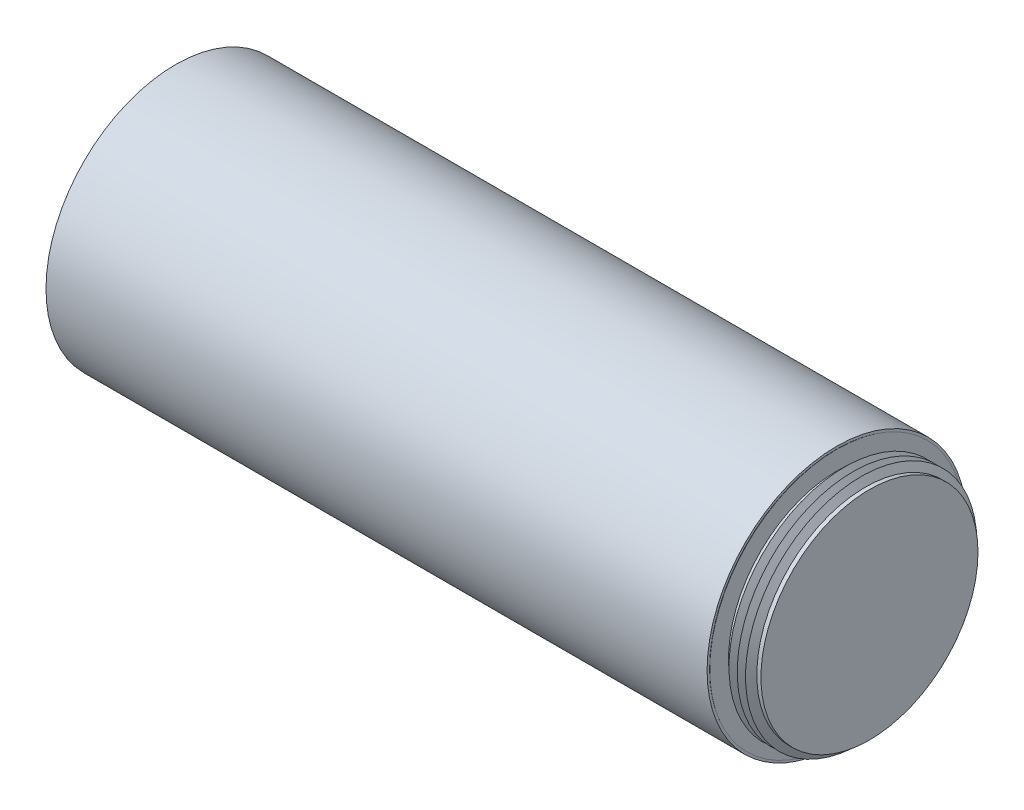
ISO-10303-21;
HEADER;
FILE_DESCRIPTION(('STEP AP214'),'2;1');
FILE_NAME('part.step','',(''),(''),'','','');
FILE_SCHEMA(('AUTOMOTIVE_DESIGN { 1 0 10303 214 1 1 1 1 }'));
ENDSEC;
DATA;
#1=APPLICATION_CONTEXT('core data for automotive mechanical design processes');
#2=APPLICATION_PROTOCOL_DEFINITION('international standard','automotive_design',2000,#1);
#3=PRODUCT_CONTEXT('',#1,'mechanical');
#4=PRODUCT('Part','Part','',(#3));
#5=PRODUCT_RELATED_PRODUCT_CATEGORY('part','',(#4));
#6=PRODUCT_DEFINITION_FORMATION('','',#4);
#7=PRODUCT_DEFINITION_CONTEXT('part definition',#1,'design');
#8=PRODUCT_DEFINITION('design','',#6,#7);
#9=PRODUCT_DEFINITION_SHAPE('','',#8);
#10=(LENGTH_UNIT() NAMED_UNIT(*) SI_UNIT(.MILLI.,.METRE.));
#11=(NAMED_UNIT(*) PLANE_ANGLE_UNIT() SI_UNIT($,.RADIAN.));
#12=(NAMED_UNIT(*) SI_UNIT($,.STERADIAN.) SOLID_ANGLE_UNIT());
#13=UNCERTAINTY_MEASURE_WITH_UNIT(LENGTH_MEASURE(1.E-05),#10,'distance_accuracy_value','');
#14=(GEOMETRIC_REPRESENTATION_CONTEXT(3) GLOBAL_UNCERTAINTY_ASSIGNED_CONTEXT((#13)) GLOBAL_UNIT_ASSIGNED_CONTEXT((#10,
#11,#12)) REPRESENTATION_CONTEXT('',''));
#15=CARTESIAN_POINT('',(0.,0.,0.));
#16=DIRECTION('',(0.,0.,1.));
#17=DIRECTION('',(1.,0.,0.));
#18=AXIS2_PLACEMENT_3D('',#15,#16,#17);
#19=CARTESIAN_POINT('',(-101.282037882412,-112.40761589404,6.95959679333066E-13));
#20=DIRECTION('',(1.,0.,0.));
#21=DIRECTION('',(0.,0.203317589338989,0.979112842253324));
#22=AXIS2_PLACEMENT_3D('',#19,#20,#21);
#23=PLANE('',#22);
#24=CARTESIAN_POINT('',(-101.282037882412,-112.40761589404,6.95959679333066E-13));
#25=DIRECTION('',(1.,0.,0.));
#26=DIRECTION('',(0.,0.203317589338989,0.979112842253324));
#27=AXIS2_PLACEMENT_3D('',#24,#25,#26);
#28=CIRCLE('',#27,49.784);
#29=CARTESIAN_POINT('',(-101.282037882411,-102.285653026388,48.7441537387402));
#30=VERTEX_POINT('',#29);
#31=EDGE_CURVE('E67',#30,#30,#28,.T.);
#32=ORIENTED_EDGE('',*,*,#31,.T.);
#33=EDGE_LOOP('',(#32));
#34=FACE_BOUND('',#33,.T.);
#35=CARTESIAN_POINT('',(-101.282037882412,-112.40761589404,8.14057642514373E-13));
#36=DIRECTION('',(1.,0.,0.));
#37=DIRECTION('',(0.,0.,-1.));
#38=AXIS2_PLACEMENT_3D('',#35,#36,#37);
#39=CIRCLE('',#38,48.8237923991093);
#40=CARTESIAN_POINT('',(-101.282037882412,-112.40761589404,-48.8237923991085));
#41=VERTEX_POINT('',#40);
#42=EDGE_CURVE('E18',#41,#41,#39,.T.);
#43=ORIENTED_EDGE('',*,*,#42,.F.);
#44=EDGE_LOOP('',(#43));
#45=FACE_BOUND('',#44,.T.);
#46=ADVANCED_FACE('F14',(#34,#45),#23,.T.);
#47=CARTESIAN_POINT('',(-355.282037882411,-112.40761589404,9.63216570958789E-13));
#48=DIRECTION('',(1.,0.,0.));
#49=DIRECTION('',(0.,0.203317589338989,0.979112842253324));
#50=AXIS2_PLACEMENT_3D('',#47,#48,#49);
#51=PLANE('',#50);
#52=CARTESIAN_POINT('',(-355.282037882411,-112.40761589404,9.63216570958789E-13));
#53=DIRECTION('',(1.,0.,0.));
#54=DIRECTION('',(0.,0.203317589338989,0.979112842253324));
#55=AXIS2_PLACEMENT_3D('',#52,#53,#54);
#56=CIRCLE('',#55,49.784);
#57=CARTESIAN_POINT('',(-355.282037882411,-102.285653026388,48.7441537387404));
#58=VERTEX_POINT('',#57);
#59=EDGE_CURVE('E68',#58,#58,#56,.T.);
#60=ORIENTED_EDGE('',*,*,#59,.F.);
#61=EDGE_LOOP('',(#60));
#62=FACE_BOUND('',#61,.T.);
#63=CARTESIAN_POINT('',(-355.282037882411,-112.40761589404,9.52272127238655E-13));
#64=DIRECTION('',(1.,0.,0.));
#65=DIRECTION('',(0.,0.,-1.));
#66=AXIS2_PLACEMENT_3D('',#63,#64,#65);
#67=CIRCLE('',#66,48.9203999999995);
#68=CARTESIAN_POINT('',(-355.282037882412,-112.40761589404,-48.9203999999986));
#69=VERTEX_POINT('',#68);
#70=EDGE_CURVE('E64',#69,#69,#67,.F.);
#71=ORIENTED_EDGE('',*,*,#70,.F.);
#72=EDGE_LOOP('',(#71));
#73=FACE_BOUND('',#72,.T.);
#74=ADVANCED_FACE('F276',(#62,#73),#51,.F.);
#75=CARTESIAN_POINT('',(-101.282037882412,-112.40761589404,6.95959679333066E-13));
#76=DIRECTION('',(-1.,0.,0.));
#77=DIRECTION('',(0.,-0.203317589338989,-0.979112842253324));
#78=AXIS2_PLACEMENT_3D('',#75,#76,#77);
#79=CYLINDRICAL_SURFACE('',#78,49.784);
#80=ORIENTED_EDGE('',*,*,#31,.F.);
#81=EDGE_LOOP('',(#80));
#82=FACE_BOUND('',#81,.T.);
#83=ORIENTED_EDGE('',*,*,#59,.T.);
#84=EDGE_LOOP('',(#83));
#85=FACE_BOUND('',#84,.T.);
#86=ADVANCED_FACE('F283',(#82,#85),#79,.T.);
#87=CARTESIAN_POINT('',(-355.282037882412,-112.40761589404,9.45369184288484E-13));
#88=DIRECTION('',(1.,0.,0.));
#89=DIRECTION('',(0.,0.999990910254518,-0.00426373173999859));
#90=AXIS2_PLACEMENT_3D('',#87,#88,#89);
#91=CIRCLE('',#90,44.45);
#92=CARTESIAN_POINT('',(-355.282037882412,-67.9580199332265,-0.189522875841992));
#93=VERTEX_POINT('',#92);
#94=EDGE_CURVE('E155',#93,#93,#91,.T.);
#95=ORIENTED_EDGE('',*,*,#94,.T.);
#96=EDGE_LOOP('',(#95));
#97=FACE_BOUND('',#96,.T.);
#98=ORIENTED_EDGE('',*,*,#70,.T.);
#99=EDGE_LOOP('',(#98));
#100=FACE_BOUND('',#99,.T.);
#101=ADVANCED_FACE('F163',(#97,#100),#51,.F.);
#102=CARTESIAN_POINT('',(-101.114708609272,-112.40761589404,7.84938641112028E-13));
#103=DIRECTION('',(1.,0.,0.));
#104=DIRECTION('',(0.,0.,-1.));
#105=AXIS2_PLACEMENT_3D('',#102,#103,#104);
#106=CONICAL_SURFACE('',#105,48.9204,0.523598775598301);
#107=ORIENTED_EDGE('',*,*,#42,.T.);
#108=EDGE_LOOP('',(#107));
#109=FACE_BOUND('',#108,.T.);
#110=CARTESIAN_POINT('',(-101.114708609272,-112.40761589404,7.84938641112028E-13));
#111=DIRECTION('',(-1.,0.,0.));
#112=DIRECTION('',(0.,0.,1.));
#113=AXIS2_PLACEMENT_3D('',#110,#111,#112);
#114=CIRCLE('',#113,48.9204);
#115=CARTESIAN_POINT('',(-101.114708609272,-112.40761589404,48.9204000000008));
#116=VERTEX_POINT('',#115);
#117=EDGE_CURVE('E9',#116,#116,#114,.T.);
#118=ORIENTED_EDGE('',*,*,#117,.T.);
#119=EDGE_LOOP('',(#118));
#120=FACE_BOUND('',#119,.T.);
#121=ADVANCED_FACE('F16',(#109,#120),#106,.T.);
#122=CARTESIAN_POINT('',(-101.114708609272,-63.4872158940397,7.84938641112028E-13));
#123=DIRECTION('',(-1.,0.,0.));
#124=DIRECTION('',(0.,0.,1.));
#125=AXIS2_PLACEMENT_3D('',#122,#123,#124);
#126=PLANE('',#125);
#127=ORIENTED_EDGE('',*,*,#117,.F.);
#128=EDGE_LOOP('',(#127));
#129=FACE_BOUND('',#128,.T.);
#130=CARTESIAN_POINT('',(-101.114708609271,-112.40761589404,7.84938641112028E-13));
#131=DIRECTION('',(1.,0.,0.));
#132=DIRECTION('',(0.,0.,-1.));
#133=AXIS2_PLACEMENT_3D('',#130,#131,#132);
#134=CIRCLE('',#133,41.70035475);
#135=CARTESIAN_POINT('',(-101.114708609271,-112.40761589404,-41.7003547499992));
#136=VERTEX_POINT('',#135);
#137=EDGE_CURVE('E23',#136,#136,#134,.T.);
#138=ORIENTED_EDGE('',*,*,#137,.F.);
#139=EDGE_LOOP('',(#138));
#140=FACE_BOUND('',#139,.T.);
#141=ADVANCED_FACE('F329',(#129,#140),#126,.F.);
#142=CARTESIAN_POINT('',(-88.6687086092715,-67.9576158940398,7.84938641112028E-13));
#143=DIRECTION('',(-1.,0.,0.));
#144=DIRECTION('',(0.,0.,1.));
#145=AXIS2_PLACEMENT_3D('',#142,#143,#144);
#146=PLANE('',#145);
#147=CARTESIAN_POINT('',(-88.6687086092715,-112.40761589404,7.84938641112028E-13));
#148=DIRECTION('',(1.,0.,0.));
#149=DIRECTION('',(0.,0.,-1.));
#150=AXIS2_PLACEMENT_3D('',#147,#148,#149);
#151=CIRCLE('',#150,41.70035475);
#152=CARTESIAN_POINT('',(-88.6687086092715,-112.40761589404,-41.7003547499992));
#153=VERTEX_POINT('',#152);
#154=EDGE_CURVE('E60',#153,#153,#151,.T.);
#155=ORIENTED_EDGE('',*,*,#154,.T.);
#156=EDGE_LOOP('',(#155));
#157=FACE_BOUND('',#156,.T.);
#158=ADVANCED_FACE('F326',(#157),#146,.F.);
#159=CARTESIAN_POINT('',(-88.6687086092715,-112.40761589404,7.84938641112028E-13));
#160=DIRECTION('',(1.,0.,0.));
#161=DIRECTION('',(0.,0.,-1.));
#162=AXIS2_PLACEMENT_3D('',#159,#160,#161);
#163=CYLINDRICAL_SURFACE('',#162,41.70035475);
#164=CARTESIAN_POINT('',(-99.7812591608523,-112.40761589404,7.84938641112028E-13));
#165=DIRECTION('',(1.,0.,0.));
#166=DIRECTION('',(0.,0.,-1.));
#167=AXIS2_PLACEMENT_3D('',#164,#165,#166);
#168=CIRCLE('',#167,41.70035475);
#169=CARTESIAN_POINT('',(-99.7812591608523,-112.40761589404,-41.7003547499992));
#170=VERTEX_POINT('',#169);
#171=EDGE_CURVE('E30',#170,#170,#168,.T.);
#172=ORIENTED_EDGE('',*,*,#171,.F.);
#173=EDGE_LOOP('',(#172));
#174=FACE_BOUND('',#173,.T.);
#175=ORIENTED_EDGE('',*,*,#137,.T.);
#176=EDGE_LOOP('',(#175));
#177=FACE_BOUND('',#176,.T.);
#178=ADVANCED_FACE('F322',(#174,#177),#163,.T.);
#179=CARTESIAN_POINT('',(-99.7812591608523,-112.40761589404,7.84938641112028E-13));
#180=DIRECTION('',(1.,0.,0.));
#181=DIRECTION('',(0.,0.,-1.));
#182=AXIS2_PLACEMENT_3D('',#179,#180,#181);
#183=CONICAL_SURFACE('',#182,41.70035475,1.0471975511966);
#184=CARTESIAN_POINT('',(-98.1937507355888,-112.40761589404,7.84938641112028E-13));
#185=DIRECTION('',(1.,0.,0.));
#186=DIRECTION('',(0.,0.,-1.));
#187=AXIS2_PLACEMENT_3D('',#184,#185,#186);
#188=CIRCLE('',#187,44.45);
#189=CARTESIAN_POINT('',(-98.1937507355888,-112.40761589404,-44.4499999999992));
#190=VERTEX_POINT('',#189);
#191=EDGE_CURVE('E36',#190,#190,#188,.T.);
#192=ORIENTED_EDGE('',*,*,#191,.F.);
#193=EDGE_LOOP('',(#192));
#194=FACE_BOUND('',#193,.T.);
#195=ORIENTED_EDGE('',*,*,#171,.T.);
#196=EDGE_LOOP('',(#195));
#197=FACE_BOUND('',#196,.T.);
#198=ADVANCED_FACE('F318',(#194,#197),#183,.T.);
#199=CARTESIAN_POINT('',(-98.1937507355888,-112.40761589404,7.84938641112028E-13));
#200=DIRECTION('',(-1.,0.,0.));
#201=DIRECTION('',(0.,0.,1.));
#202=AXIS2_PLACEMENT_3D('',#199,#200,#201);
#203=CONICAL_SURFACE('',#202,44.45,1.0471975511966);
#204=CARTESIAN_POINT('',(-96.6062423103254,-112.40761589404,7.84938641112028E-13));
#205=DIRECTION('',(1.,0.,0.));
#206=DIRECTION('',(0.,0.,-1.));
#207=AXIS2_PLACEMENT_3D('',#204,#205,#206);
#208=CIRCLE('',#207,41.70035475);
#209=CARTESIAN_POINT('',(-96.6062423103254,-112.40761589404,-41.7003547499992));
#210=VERTEX_POINT('',#209);
#211=EDGE_CURVE('E40',#210,#210,#208,.T.);
#212=ORIENTED_EDGE('',*,*,#211,.F.);
#213=EDGE_LOOP('',(#212));
#214=FACE_BOUND('',#213,.T.);
#215=ORIENTED_EDGE('',*,*,#191,.T.);
#216=EDGE_LOOP('',(#215));
#217=FACE_BOUND('',#216,.T.);
#218=ADVANCED_FACE('F314',(#214,#217),#203,.T.);
#219=CARTESIAN_POINT('',(-96.6062423103254,-112.40761589404,7.84938641112028E-13));
#220=DIRECTION('',(1.,0.,0.));
#221=DIRECTION('',(0.,0.,-1.));
#222=AXIS2_PLACEMENT_3D('',#219,#220,#221);
#223=CONICAL_SURFACE('',#222,41.70035475,1.0471975511966);
#224=CARTESIAN_POINT('',(-95.0187338850619,-112.40761589404,7.84938641112028E-13));
#225=DIRECTION('',(1.,0.,0.));
#226=DIRECTION('',(0.,0.,-1.));
#227=AXIS2_PLACEMENT_3D('',#224,#225,#226);
#228=CIRCLE('',#227,44.45);
#229=CARTESIAN_POINT('',(-95.0187338850619,-112.40761589404,-44.4499999999992));
#230=VERTEX_POINT('',#229);
#231=EDGE_CURVE('E44',#230,#230,#228,.T.);
#232=ORIENTED_EDGE('',*,*,#231,.F.);
#233=EDGE_LOOP('',(#232));
#234=FACE_BOUND('',#233,.T.);
#235=ORIENTED_EDGE('',*,*,#211,.T.);
#236=EDGE_LOOP('',(#235));
#237=FACE_BOUND('',#236,.T.);
#238=ADVANCED_FACE('F310',(#234,#237),#223,.T.);
#239=CARTESIAN_POINT('',(-95.0187338850619,-112.40761589404,7.84938641112028E-13));
#240=DIRECTION('',(-1.,0.,0.));
#241=DIRECTION('',(0.,0.,1.));
#242=AXIS2_PLACEMENT_3D('',#239,#240,#241);
#243=CONICAL_SURFACE('',#242,44.45,1.0471975511966);
#244=CARTESIAN_POINT('',(-93.4312254597984,-112.40761589404,7.84938641112028E-13));
#245=DIRECTION('',(1.,0.,0.));
#246=DIRECTION('',(0.,0.,-1.));
#247=AXIS2_PLACEMENT_3D('',#244,#245,#246);
#248=CIRCLE('',#247,41.70035475);
#249=CARTESIAN_POINT('',(-93.4312254597984,-112.40761589404,-41.7003547499992));
#250=VERTEX_POINT('',#249);
#251=EDGE_CURVE('E48',#250,#250,#248,.T.);
#252=ORIENTED_EDGE('',*,*,#251,.F.);
#253=EDGE_LOOP('',(#252));
#254=FACE_BOUND('',#253,.T.);
#255=ORIENTED_EDGE('',*,*,#231,.T.);
#256=EDGE_LOOP('',(#255));
#257=FACE_BOUND('',#256,.T.);
#258=ADVANCED_FACE('F306',(#254,#257),#243,.T.);
#259=CARTESIAN_POINT('',(-93.4312254597984,-112.40761589404,7.84938641112028E-13));
#260=DIRECTION('',(1.,0.,0.));
#261=DIRECTION('',(0.,0.,-1.));
#262=AXIS2_PLACEMENT_3D('',#259,#260,#261);
#263=CONICAL_SURFACE('',#262,41.70035475,1.0471975511966);
#264=CARTESIAN_POINT('',(-91.843717034535,-112.40761589404,7.84938641112028E-13));
#265=DIRECTION('',(1.,0.,0.));
#266=DIRECTION('',(0.,0.,-1.));
#267=AXIS2_PLACEMENT_3D('',#264,#265,#266);
#268=CIRCLE('',#267,44.45);
#269=CARTESIAN_POINT('',(-91.843717034535,-112.40761589404,-44.4499999999992));
#270=VERTEX_POINT('',#269);
#271=EDGE_CURVE('E52',#270,#270,#268,.T.);
#272=ORIENTED_EDGE('',*,*,#271,.F.);
#273=EDGE_LOOP('',(#272));
#274=FACE_BOUND('',#273,.T.);
#275=ORIENTED_EDGE('',*,*,#251,.T.);
#276=EDGE_LOOP('',(#275));
#277=FACE_BOUND('',#276,.T.);
#278=ADVANCED_FACE('F302',(#274,#277),#263,.T.);
#279=CARTESIAN_POINT('',(-91.843717034535,-112.40761589404,7.84938641112028E-13));
#280=DIRECTION('',(-1.,0.,0.));
#281=DIRECTION('',(0.,0.,1.));
#282=AXIS2_PLACEMENT_3D('',#279,#280,#281);
#283=CONICAL_SURFACE('',#282,44.45,1.04719755119659);
#284=CARTESIAN_POINT('',(-90.2562086092715,-112.40761589404,7.84938641112028E-13));
#285=DIRECTION('',(1.,0.,0.));
#286=DIRECTION('',(0.,0.,-1.));
#287=AXIS2_PLACEMENT_3D('',#284,#285,#286);
#288=CIRCLE('',#287,41.70035475);
#289=CARTESIAN_POINT('',(-90.2562086092715,-112.40761589404,-41.7003547499992));
#290=VERTEX_POINT('',#289);
#291=EDGE_CURVE('E56',#290,#290,#288,.T.);
#292=ORIENTED_EDGE('',*,*,#291,.F.);
#293=EDGE_LOOP('',(#292));
#294=FACE_BOUND('',#293,.T.);
#295=ORIENTED_EDGE('',*,*,#271,.T.);
#296=EDGE_LOOP('',(#295));
#297=FACE_BOUND('',#296,.T.);
#298=ADVANCED_FACE('F298',(#294,#297),#283,.T.);
#299=CARTESIAN_POINT('',(-88.6687086092715,-112.40761589404,7.84938641112028E-13));
#300=DIRECTION('',(1.,0.,0.));
#301=DIRECTION('',(0.,0.,-1.));
#302=AXIS2_PLACEMENT_3D('',#299,#300,#301);
#303=CYLINDRICAL_SURFACE('',#302,41.70035475);
#304=ORIENTED_EDGE('',*,*,#154,.F.);
#305=EDGE_LOOP('',(#304));
#306=FACE_BOUND('',#305,.T.);
#307=ORIENTED_EDGE('',*,*,#291,.T.);
#308=EDGE_LOOP('',(#307));
#309=FACE_BOUND('',#308,.T.);
#310=ADVANCED_FACE('F295',(#306,#309),#303,.T.);
#311=CARTESIAN_POINT('',(-310.578037882412,-112.40761589404,7.47559295308866E-13));
#312=DIRECTION('',(-1.,0.,0.));
#313=DIRECTION('',(0.,0.,1.));
#314=AXIS2_PLACEMENT_3D('',#311,#312,#313);
#315=PLANE('',#314);
#316=CARTESIAN_POINT('',(-310.578037882412,-112.40761589404,7.47559295308866E-13));
#317=DIRECTION('',(-1.,0.,0.));
#318=DIRECTION('',(0.,-0.999990910254518,0.00426373173999859));
#319=AXIS2_PLACEMENT_3D('',#316,#317,#318);
#320=CIRCLE('',#319,36.449);
#321=CARTESIAN_POINT('',(-310.578037882412,-148.856284581907,0.155408758191956));
#322=VERTEX_POINT('',#321);
#323=EDGE_CURVE('E151',#322,#322,#320,.T.);
#324=ORIENTED_EDGE('',*,*,#323,.T.);
#325=EDGE_LOOP('',(#324));
#326=FACE_BOUND('',#325,.T.);
#327=ADVANCED_FACE('F288',(#326),#315,.T.);
#328=CARTESIAN_POINT('',(-312.102037882412,-112.40761589404,8.18305259361117E-13));
#329=DIRECTION('',(1.,0.,0.));
#330=DIRECTION('',(0.,0.999990910254518,-0.00426373173999859));
#331=AXIS2_PLACEMENT_3D('',#328,#329,#330);
#332=CONICAL_SURFACE('',#331,34.925,0.785398163397451);
#333=ORIENTED_EDGE('',*,*,#323,.F.);
#334=EDGE_LOOP('',(#333));
#335=FACE_BOUND('',#334,.T.);
#336=CARTESIAN_POINT('',(-312.102037882412,-112.40761589404,8.18305259361117E-13));
#337=DIRECTION('',(-1.,0.,0.));
#338=DIRECTION('',(0.,-0.999990910254518,0.00426373173999859));
#339=AXIS2_PLACEMENT_3D('',#336,#337,#338);
#340=CIRCLE('',#339,34.925);
#341=CARTESIAN_POINT('',(-312.102037882412,-147.332298434679,0.148910831020269));
#342=VERTEX_POINT('',#341);
#343=EDGE_CURVE('E143',#342,#342,#340,.F.);
#344=ORIENTED_EDGE('',*,*,#343,.F.);
#345=EDGE_LOOP('',(#344));
#346=FACE_BOUND('',#345,.T.);
#347=ADVANCED_FACE('F170',(#335,#346),#332,.F.);
#348=CARTESIAN_POINT('',(-355.282037882412,-112.40761589404,9.45369184288484E-13));
#349=DIRECTION('',(1.,0.,0.));
#350=DIRECTION('',(0.,0.999990910254518,-0.00426373173999859));
#351=AXIS2_PLACEMENT_3D('',#348,#349,#350);
#352=CYLINDRICAL_SURFACE('',#351,44.45);
#353=ORIENTED_EDGE('',*,*,#94,.F.);
#354=EDGE_LOOP('',(#353));
#355=FACE_BOUND('',#354,.T.);
#356=CARTESIAN_POINT('',(-353.504037882412,-112.40761589404,9.43660601045239E-13));
#357=DIRECTION('',(1.,0.,0.));
#358=DIRECTION('',(0.,0.999990910254518,-0.00426373173999859));
#359=AXIS2_PLACEMENT_3D('',#356,#357,#358);
#360=CIRCLE('',#359,44.45);
#361=CARTESIAN_POINT('',(-353.504037882412,-67.9580199332265,-0.189522875841994));
#362=VERTEX_POINT('',#361);
#363=EDGE_CURVE('E72',#362,#362,#360,.T.);
#364=ORIENTED_EDGE('',*,*,#363,.T.);
#365=EDGE_LOOP('',(#364));
#366=FACE_BOUND('',#365,.T.);
#367=ADVANCED_FACE('F166',(#355,#366),#352,.F.);
#368=CARTESIAN_POINT('',(-351.916529457149,-112.40761589404,9.42545517457964E-13));
#369=DIRECTION('',(-1.,0.,0.));
#370=DIRECTION('',(0.,-0.999990910254518,0.00426373173999859));
#371=AXIS2_PLACEMENT_3D('',#368,#369,#370);
#372=CONICAL_SURFACE('',#371,41.70035475,1.0471975511966);
#373=ORIENTED_EDGE('',*,*,#363,.F.);
#374=EDGE_LOOP('',(#373));
#375=FACE_BOUND('',#374,.T.);
#376=CARTESIAN_POINT('',(-351.916529457149,-112.40761589404,9.42545517457964E-13));
#377=DIRECTION('',(1.,0.,0.));
#378=DIRECTION('',(0.,0.999990910254518,-0.00426373173999859));
#379=AXIS2_PLACEMENT_3D('',#376,#377,#378);
#380=CIRCLE('',#379,41.70035475);
#381=CARTESIAN_POINT('',(-351.916529457149,-70.707640189651,-0.177799126115834));
#382=VERTEX_POINT('',#381);
#383=EDGE_CURVE('E79',#382,#382,#380,.T.);
#384=ORIENTED_EDGE('',*,*,#383,.T.);
#385=EDGE_LOOP('',(#384));
#386=FACE_BOUND('',#385,.T.);
#387=ADVANCED_FACE('F169',(#375,#386),#372,.F.);
#388=CARTESIAN_POINT('',(-350.329021031885,-112.40761589404,9.40996756943743E-13));
#389=DIRECTION('',(1.,0.,0.));
#390=DIRECTION('',(0.,0.999990910254518,-0.00426373173999859));
#391=AXIS2_PLACEMENT_3D('',#388,#389,#390);
#392=CONICAL_SURFACE('',#391,44.45,1.04719755119659);
#393=ORIENTED_EDGE('',*,*,#383,.F.);
#394=EDGE_LOOP('',(#393));
#395=FACE_BOUND('',#394,.T.);
#396=CARTESIAN_POINT('',(-350.329021031885,-112.40761589404,9.40996756943743E-13));
#397=DIRECTION('',(1.,0.,0.));
#398=DIRECTION('',(0.,0.999990910254518,-0.00426373173999859));
#399=AXIS2_PLACEMENT_3D('',#396,#397,#398);
#400=CIRCLE('',#399,44.45);
#401=CARTESIAN_POINT('',(-350.329021031885,-67.9580199332265,-0.189522875841996));
#402=VERTEX_POINT('',#401);
#403=EDGE_CURVE('E83',#402,#402,#400,.T.);
#404=ORIENTED_EDGE('',*,*,#403,.T.);
#405=EDGE_LOOP('',(#404));
#406=FACE_BOUND('',#405,.T.);
#407=ADVANCED_FACE('F176',(#395,#406),#392,.F.);
#408=CARTESIAN_POINT('',(-348.741516819237,-112.40761589404,9.39664838427386E-13));
#409=DIRECTION('',(-1.,0.,0.));
#410=DIRECTION('',(0.,-0.999990910254518,0.00426373173999859));
#411=AXIS2_PLACEMENT_3D('',#408,#409,#410);
#412=CONICAL_SURFACE('',#411,41.7003620464632,1.0471975511966);
#413=ORIENTED_EDGE('',*,*,#403,.F.);
#414=EDGE_LOOP('',(#413));
#415=FACE_BOUND('',#414,.T.);
#416=CARTESIAN_POINT('',(-348.741516819237,-112.40761589404,9.39664838427386E-13));
#417=DIRECTION('',(1.,0.,0.));
#418=DIRECTION('',(0.,0.999990910254518,-0.00426373173999859));
#419=AXIS2_PLACEMENT_3D('',#416,#417,#418);
#420=CIRCLE('',#419,41.7003620464632);
#421=CARTESIAN_POINT('',(-348.741516819237,-70.7076328932541,-0.177799157225998));
#422=VERTEX_POINT('',#421);
#423=EDGE_CURVE('E87',#422,#422,#420,.T.);
#424=ORIENTED_EDGE('',*,*,#423,.T.);
#425=EDGE_LOOP('',(#424));
#426=FACE_BOUND('',#425,.T.);
#427=ADVANCED_FACE('F182',(#415,#426),#412,.F.);
#428=CARTESIAN_POINT('',(-347.154008393973,-112.40761589404,9.38332916376638E-13));
#429=DIRECTION('',(1.,0.,0.));
#430=DIRECTION('',(0.,0.999990910254518,-0.00426373173999859));
#431=AXIS2_PLACEMENT_3D('',#428,#429,#430);
#432=CONICAL_SURFACE('',#431,44.4500072964631,1.04719755119659);
#433=ORIENTED_EDGE('',*,*,#423,.F.);
#434=EDGE_LOOP('',(#433));
#435=FACE_BOUND('',#434,.T.);
#436=CARTESIAN_POINT('',(-347.154008393973,-112.40761589404,9.38332916376638E-13));
#437=DIRECTION('',(1.,0.,0.));
#438=DIRECTION('',(0.,0.999990910254518,-0.00426373173999859));
#439=AXIS2_PLACEMENT_3D('',#436,#437,#438);
#440=CIRCLE('',#439,44.4500072964631);
#441=CARTESIAN_POINT('',(-347.154008393973,-67.9580126368296,-0.189522906952161));
#442=VERTEX_POINT('',#441);
#443=EDGE_CURVE('E91',#442,#442,#440,.T.);
#444=ORIENTED_EDGE('',*,*,#443,.T.);
#445=EDGE_LOOP('',(#444));
#446=FACE_BOUND('',#445,.T.);
#447=ADVANCED_FACE('F188',(#435,#446),#432,.F.);
#448=CARTESIAN_POINT('',(-345.566504181325,-112.40761589404,9.37000997860281E-13));
#449=DIRECTION('',(-1.,0.,0.));
#450=DIRECTION('',(0.,-0.999990910254518,0.00426373173999859));
#451=AXIS2_PLACEMENT_3D('',#448,#449,#450);
#452=CONICAL_SURFACE('',#451,41.7003693429263,1.0471975511966);
#453=ORIENTED_EDGE('',*,*,#443,.F.);
#454=EDGE_LOOP('',(#453));
#455=FACE_BOUND('',#454,.T.);
#456=CARTESIAN_POINT('',(-345.566504181325,-112.40761589404,9.37000997860281E-13));
#457=DIRECTION('',(1.,0.,0.));
#458=DIRECTION('',(0.,0.999990910254518,-0.00426373173999859));
#459=AXIS2_PLACEMENT_3D('',#456,#457,#458);
#460=CIRCLE('',#459,41.7003693429263);
#461=CARTESIAN_POINT('',(-345.566504181325,-70.7076255968573,-0.177799188336162));
#462=VERTEX_POINT('',#461);
#463=EDGE_CURVE('E95',#462,#462,#460,.T.);
#464=ORIENTED_EDGE('',*,*,#463,.T.);
#465=EDGE_LOOP('',(#464));
#466=FACE_BOUND('',#465,.T.);
#467=ADVANCED_FACE('F194',(#455,#466),#452,.F.);
#468=CARTESIAN_POINT('',(-343.978995756061,-112.40761589404,9.35669075809533E-13));
#469=DIRECTION('',(1.,0.,0.));
#470=DIRECTION('',(0.,0.999990910254518,-0.00426373173999859));
#471=AXIS2_PLACEMENT_3D('',#468,#469,#470);
#472=CONICAL_SURFACE('',#471,44.4500145929263,1.04719755119659);
#473=ORIENTED_EDGE('',*,*,#463,.F.);
#474=EDGE_LOOP('',(#473));
#475=FACE_BOUND('',#474,.T.);
#476=CARTESIAN_POINT('',(-343.978995756061,-112.40761589404,9.35669075809533E-13));
#477=DIRECTION('',(1.,0.,0.));
#478=DIRECTION('',(0.,0.999990910254518,-0.00426373173999859));
#479=AXIS2_PLACEMENT_3D('',#476,#477,#478);
#480=CIRCLE('',#479,44.4500145929263);
#481=CARTESIAN_POINT('',(-343.978995756061,-67.9580053404328,-0.189522938062325));
#482=VERTEX_POINT('',#481);
#483=EDGE_CURVE('E99',#482,#482,#480,.T.);
#484=ORIENTED_EDGE('',*,*,#483,.T.);
#485=EDGE_LOOP('',(#484));
#486=FACE_BOUND('',#485,.T.);
#487=ADVANCED_FACE('F200',(#475,#486),#472,.F.);
#488=CARTESIAN_POINT('',(-342.391491543413,-112.40761589404,9.34337157293176E-13));
#489=DIRECTION('',(-1.,0.,0.));
#490=DIRECTION('',(0.,-0.999990910254518,0.00426373173999859));
#491=AXIS2_PLACEMENT_3D('',#488,#489,#490);
#492=CONICAL_SURFACE('',#491,41.7003766393895,1.0471975511966);
#493=ORIENTED_EDGE('',*,*,#483,.F.);
#494=EDGE_LOOP('',(#493));
#495=FACE_BOUND('',#494,.T.);
#496=CARTESIAN_POINT('',(-342.391491543413,-112.40761589404,9.34337157293176E-13));
#497=DIRECTION('',(1.,0.,0.));
#498=DIRECTION('',(0.,0.999990910254518,-0.00426373173999859));
#499=AXIS2_PLACEMENT_3D('',#496,#497,#498);
#500=CIRCLE('',#499,41.7003766393895);
#501=CARTESIAN_POINT('',(-342.391491543413,-70.7076183004604,-0.177799219446327));
#502=VERTEX_POINT('',#501);
#503=EDGE_CURVE('E103',#502,#502,#500,.T.);
#504=ORIENTED_EDGE('',*,*,#503,.T.);
#505=EDGE_LOOP('',(#504));
#506=FACE_BOUND('',#505,.T.);
#507=ADVANCED_FACE('F206',(#495,#506),#492,.F.);
#508=CARTESIAN_POINT('',(-340.803983118149,-112.40761589404,9.33005235242427E-13));
#509=DIRECTION('',(1.,0.,0.));
#510=DIRECTION('',(0.,0.999990910254518,-0.00426373173999859));
#511=AXIS2_PLACEMENT_3D('',#508,#509,#510);
#512=CONICAL_SURFACE('',#511,44.4500218893895,1.04719755119659);
#513=ORIENTED_EDGE('',*,*,#503,.F.);
#514=EDGE_LOOP('',(#513));
#515=FACE_BOUND('',#514,.T.);
#516=CARTESIAN_POINT('',(-340.803983118149,-112.40761589404,9.33005235242427E-13));
#517=DIRECTION('',(1.,0.,0.));
#518=DIRECTION('',(0.,0.999990910254518,-0.00426373173999859));
#519=AXIS2_PLACEMENT_3D('',#516,#517,#518);
#520=CIRCLE('',#519,44.4500218893895);
#521=CARTESIAN_POINT('',(-340.803983118149,-67.9579980440359,-0.189522969172489));
#522=VERTEX_POINT('',#521);
#523=EDGE_CURVE('E107',#522,#522,#520,.T.);
#524=ORIENTED_EDGE('',*,*,#523,.T.);
#525=EDGE_LOOP('',(#524));
#526=FACE_BOUND('',#525,.T.);
#527=ADVANCED_FACE('F212',(#515,#526),#512,.F.);
#528=CARTESIAN_POINT('',(-339.216478905501,-112.40761589404,9.3167331672607E-13));
#529=DIRECTION('',(-1.,0.,0.));
#530=DIRECTION('',(0.,-0.999990910254518,0.00426373173999859));
#531=AXIS2_PLACEMENT_3D('',#528,#529,#530);
#532=CONICAL_SURFACE('',#531,41.7003839358526,1.0471975511966);
#533=ORIENTED_EDGE('',*,*,#523,.F.);
#534=EDGE_LOOP('',(#533));
#535=FACE_BOUND('',#534,.T.);
#536=CARTESIAN_POINT('',(-339.216478905501,-112.40761589404,9.3167331672607E-13));
#537=DIRECTION('',(1.,0.,0.));
#538=DIRECTION('',(0.,0.999990910254518,-0.00426373173999859));
#539=AXIS2_PLACEMENT_3D('',#536,#537,#538);
#540=CIRCLE('',#539,41.7003839358526);
#541=CARTESIAN_POINT('',(-339.216478905501,-70.7076110040636,-0.177799250556491));
#542=VERTEX_POINT('',#541);
#543=EDGE_CURVE('E111',#542,#542,#540,.T.);
#544=ORIENTED_EDGE('',*,*,#543,.T.);
#545=EDGE_LOOP('',(#544));
#546=FACE_BOUND('',#545,.T.);
#547=ADVANCED_FACE('F218',(#535,#546),#532,.F.);
#548=CARTESIAN_POINT('',(-337.628970480238,-112.40761589404,9.30341394675322E-13));
#549=DIRECTION('',(1.,0.,0.));
#550=DIRECTION('',(0.,0.999990910254518,-0.00426373173999859));
#551=AXIS2_PLACEMENT_3D('',#548,#549,#550);
#552=CONICAL_SURFACE('',#551,44.4500291858527,1.04719755119659);
#553=ORIENTED_EDGE('',*,*,#543,.F.);
#554=EDGE_LOOP('',(#553));
#555=FACE_BOUND('',#554,.T.);
#556=CARTESIAN_POINT('',(-337.628970480238,-112.40761589404,9.30341394675322E-13));
#557=DIRECTION('',(1.,0.,0.));
#558=DIRECTION('',(0.,0.999990910254518,-0.00426373173999859));
#559=AXIS2_PLACEMENT_3D('',#556,#557,#558);
#560=CIRCLE('',#559,44.4500291858527);
#561=CARTESIAN_POINT('',(-337.628970480238,-67.9579907476391,-0.189523000282654));
#562=VERTEX_POINT('',#561);
#563=EDGE_CURVE('E115',#562,#562,#560,.T.);
#564=ORIENTED_EDGE('',*,*,#563,.T.);
#565=EDGE_LOOP('',(#564));
#566=FACE_BOUND('',#565,.T.);
#567=ADVANCED_FACE('F224',(#555,#566),#552,.F.);
#568=CARTESIAN_POINT('',(-336.041466267589,-112.40761589404,9.29009476158964E-13));
#569=DIRECTION('',(-1.,0.,0.));
#570=DIRECTION('',(0.,-0.999990910254518,0.00426373173999859));
#571=AXIS2_PLACEMENT_3D('',#568,#569,#570);
#572=CONICAL_SURFACE('',#571,41.7003912323158,1.0471975511966);
#573=ORIENTED_EDGE('',*,*,#563,.F.);
#574=EDGE_LOOP('',(#573));
#575=FACE_BOUND('',#574,.T.);
#576=CARTESIAN_POINT('',(-336.041466267589,-112.40761589404,9.29009476158964E-13));
#577=DIRECTION('',(1.,0.,0.));
#578=DIRECTION('',(0.,0.999990910254518,-0.00426373173999859));
#579=AXIS2_PLACEMENT_3D('',#576,#577,#578);
#580=CIRCLE('',#579,41.7003912323158);
#581=CARTESIAN_POINT('',(-336.041466267589,-70.7076037076667,-0.177799281666655));
#582=VERTEX_POINT('',#581);
#583=EDGE_CURVE('E119',#582,#582,#580,.T.);
#584=ORIENTED_EDGE('',*,*,#583,.T.);
#585=EDGE_LOOP('',(#584));
#586=FACE_BOUND('',#585,.T.);
#587=ADVANCED_FACE('F230',(#575,#586),#572,.F.);
#588=CARTESIAN_POINT('',(-334.453957842326,-112.40761589404,9.27677554108216E-13));
#589=DIRECTION('',(1.,0.,0.));
#590=DIRECTION('',(0.,0.999990910254518,-0.00426373173999859));
#591=AXIS2_PLACEMENT_3D('',#588,#589,#590);
#592=CONICAL_SURFACE('',#591,44.4500364823158,1.04719755119659);
#593=ORIENTED_EDGE('',*,*,#583,.F.);
#594=EDGE_LOOP('',(#593));
#595=FACE_BOUND('',#594,.T.);
#596=CARTESIAN_POINT('',(-334.453957842326,-112.40761589404,9.27677554108216E-13));
#597=DIRECTION('',(1.,0.,0.));
#598=DIRECTION('',(0.,0.999990910254518,-0.00426373173999859));
#599=AXIS2_PLACEMENT_3D('',#596,#597,#598);
#600=CIRCLE('',#599,44.4500364823158);
#601=CARTESIAN_POINT('',(-334.453957842326,-67.9579834512422,-0.189523031392818));
#602=VERTEX_POINT('',#601);
#603=EDGE_CURVE('E123',#602,#602,#600,.T.);
#604=ORIENTED_EDGE('',*,*,#603,.T.);
#605=EDGE_LOOP('',(#604));
#606=FACE_BOUND('',#605,.T.);
#607=ADVANCED_FACE('F236',(#595,#606),#592,.F.);
#608=CARTESIAN_POINT('',(-332.866453629677,-112.40761589404,9.26345635591859E-13));
#609=DIRECTION('',(-1.,0.,0.));
#610=DIRECTION('',(0.,-0.999990910254518,0.00426373173999859));
#611=AXIS2_PLACEMENT_3D('',#608,#609,#610);
#612=CONICAL_SURFACE('',#611,41.700398528779,1.0471975511966);
#613=ORIENTED_EDGE('',*,*,#603,.F.);
#614=EDGE_LOOP('',(#613));
#615=FACE_BOUND('',#614,.T.);
#616=CARTESIAN_POINT('',(-332.866453629677,-112.40761589404,9.26345635591859E-13));
#617=DIRECTION('',(1.,0.,0.));
#618=DIRECTION('',(0.,0.999990910254518,-0.00426373173999859));
#619=AXIS2_PLACEMENT_3D('',#616,#617,#618);
#620=CIRCLE('',#619,41.700398528779);
#621=CARTESIAN_POINT('',(-332.866453629677,-70.7075964112699,-0.177799312776819));
#622=VERTEX_POINT('',#621);
#623=EDGE_CURVE('E127',#622,#622,#620,.T.);
#624=ORIENTED_EDGE('',*,*,#623,.T.);
#625=EDGE_LOOP('',(#624));
#626=FACE_BOUND('',#625,.T.);
#627=ADVANCED_FACE('F242',(#615,#626),#612,.F.);
#628=CARTESIAN_POINT('',(-331.278945204414,-112.40761589404,9.25013713541111E-13));
#629=DIRECTION('',(1.,0.,0.));
#630=DIRECTION('',(0.,0.999990910254518,-0.00426373173999859));
#631=AXIS2_PLACEMENT_3D('',#628,#629,#630);
#632=CONICAL_SURFACE('',#631,44.450043778779,1.04719755119659);
#633=ORIENTED_EDGE('',*,*,#623,.F.);
#634=EDGE_LOOP('',(#633));
#635=FACE_BOUND('',#634,.T.);
#636=CARTESIAN_POINT('',(-331.278945204414,-112.40761589404,9.25013713541111E-13));
#637=DIRECTION('',(1.,0.,0.));
#638=DIRECTION('',(0.,0.999990910254518,-0.00426373173999859));
#639=AXIS2_PLACEMENT_3D('',#636,#637,#638);
#640=CIRCLE('',#639,44.450043778779);
#641=CARTESIAN_POINT('',(-331.278945204414,-67.9579761548454,-0.189523062502982));
#642=VERTEX_POINT('',#641);
#643=EDGE_CURVE('E131',#642,#642,#640,.T.);
#644=ORIENTED_EDGE('',*,*,#643,.T.);
#645=EDGE_LOOP('',(#644));
#646=FACE_BOUND('',#645,.T.);
#647=ADVANCED_FACE('F248',(#635,#646),#632,.F.);
#648=CARTESIAN_POINT('',(-355.282037882412,-112.40761589404,9.45369184288484E-13));
#649=DIRECTION('',(1.,0.,0.));
#650=DIRECTION('',(0.,0.999990910254518,-0.00426373173999859));
#651=AXIS2_PLACEMENT_3D('',#648,#649,#650);
#652=CYLINDRICAL_SURFACE('',#651,44.450043778779);
#653=ORIENTED_EDGE('',*,*,#643,.F.);
#654=EDGE_LOOP('',(#653));
#655=FACE_BOUND('',#654,.T.);
#656=CARTESIAN_POINT('',(-329.628037882413,-112.40761589404,9.23628599716881E-13));
#657=DIRECTION('',(1.,0.,0.));
#658=DIRECTION('',(0.,0.999990910254518,-0.00426373173999859));
#659=AXIS2_PLACEMENT_3D('',#656,#657,#658);
#660=CIRCLE('',#659,44.450043778779);
#661=CARTESIAN_POINT('',(-329.628037882413,-67.9579761548454,-0.189523062502983));
#662=VERTEX_POINT('',#661);
#663=EDGE_CURVE('E135',#662,#662,#660,.T.);
#664=ORIENTED_EDGE('',*,*,#663,.T.);
#665=EDGE_LOOP('',(#664));
#666=FACE_BOUND('',#665,.T.);
#667=ADVANCED_FACE('F254',(#655,#666),#652,.F.);
#668=CARTESIAN_POINT('',(-329.628037882412,-112.40761589404,9.2362859971688E-13));
#669=DIRECTION('',(-1.,0.,0.));
#670=DIRECTION('',(0.,-0.999990910254518,0.00426373173999859));
#671=AXIS2_PLACEMENT_3D('',#668,#669,#670);
#672=PLANE('',#671);
#673=CARTESIAN_POINT('',(-329.628037882412,-112.40761589404,9.2362859971688E-13));
#674=DIRECTION('',(-1.,0.,0.));
#675=DIRECTION('',(0.,-0.999990910254518,0.00426373173999859));
#676=AXIS2_PLACEMENT_3D('',#673,#674,#675);
#677=CIRCLE('',#676,36.449);
#678=CARTESIAN_POINT('',(-329.628037882412,-148.856284581907,0.155408758192132));
#679=VERTEX_POINT('',#678);
#680=EDGE_CURVE('E139',#679,#679,#677,.F.);
#681=ORIENTED_EDGE('',*,*,#680,.T.);
#682=EDGE_LOOP('',(#681));
#683=FACE_BOUND('',#682,.T.);
#684=ORIENTED_EDGE('',*,*,#663,.F.);
#685=EDGE_LOOP('',(#684));
#686=FACE_BOUND('',#685,.T.);
#687=ADVANCED_FACE('F260',(#683,#686),#672,.T.);
#688=CARTESIAN_POINT('',(-329.628037882412,-112.40761589404,9.2362859971688E-13));
#689=DIRECTION('',(-1.,0.,0.));
#690=DIRECTION('',(0.,-0.999990910254518,0.00426373173999859));
#691=AXIS2_PLACEMENT_3D('',#688,#689,#690);
#692=CONICAL_SURFACE('',#691,36.449,0.785398163397447);
#693=CARTESIAN_POINT('',(-328.104037882412,-112.40761589404,9.2234996133422E-13));
#694=DIRECTION('',(-1.,0.,0.));
#695=DIRECTION('',(0.,-0.999990910254518,0.00426373173999859));
#696=AXIS2_PLACEMENT_3D('',#693,#694,#695);
#697=CIRCLE('',#696,34.925);
#698=CARTESIAN_POINT('',(-328.104037882412,-147.332298434679,0.148910831020373));
#699=VERTEX_POINT('',#698);
#700=EDGE_CURVE('E147',#699,#699,#697,.T.);
#701=ORIENTED_EDGE('',*,*,#700,.F.);
#702=EDGE_LOOP('',(#701));
#703=FACE_BOUND('',#702,.T.);
#704=ORIENTED_EDGE('',*,*,#680,.F.);
#705=EDGE_LOOP('',(#704));
#706=FACE_BOUND('',#705,.T.);
#707=ADVANCED_FACE('F265',(#703,#706),#692,.F.);
#708=CARTESIAN_POINT('',(-355.282037882412,-112.40761589404,9.45369184288484E-13));
#709=DIRECTION('',(1.,0.,0.));
#710=DIRECTION('',(0.,0.999990910254518,-0.00426373173999859));
#711=AXIS2_PLACEMENT_3D('',#708,#709,#710);
#712=CYLINDRICAL_SURFACE('',#711,34.925);
#713=ORIENTED_EDGE('',*,*,#700,.T.);
#714=EDGE_LOOP('',(#713));
#715=FACE_BOUND('',#714,.T.);
#716=ORIENTED_EDGE('',*,*,#343,.T.);
#717=EDGE_LOOP('',(#716));
#718=FACE_BOUND('',#717,.T.);
#719=ADVANCED_FACE('F272',(#715,#718),#712,.F.);
#720=CLOSED_SHELL('',(#46,#74,#86,#101,#121,#141,#158,#178,#198,#218,#238,#258,#278,#298,#310,
#327,#347,#367,#387,#407,#427,#447,#467,#487,#507,#527,#547,#567,#587,#607,#627,#647,#667,#687,
#707,#719));
#721=MANIFOLD_SOLID_BREP('B1',#720);
#722=ADVANCED_BREP_SHAPE_REPRESENTATION('',(#18,#721),#14);
#723=SHAPE_DEFINITION_REPRESENTATION(#9,#722);
ENDSEC;
END-ISO-10303-21;
